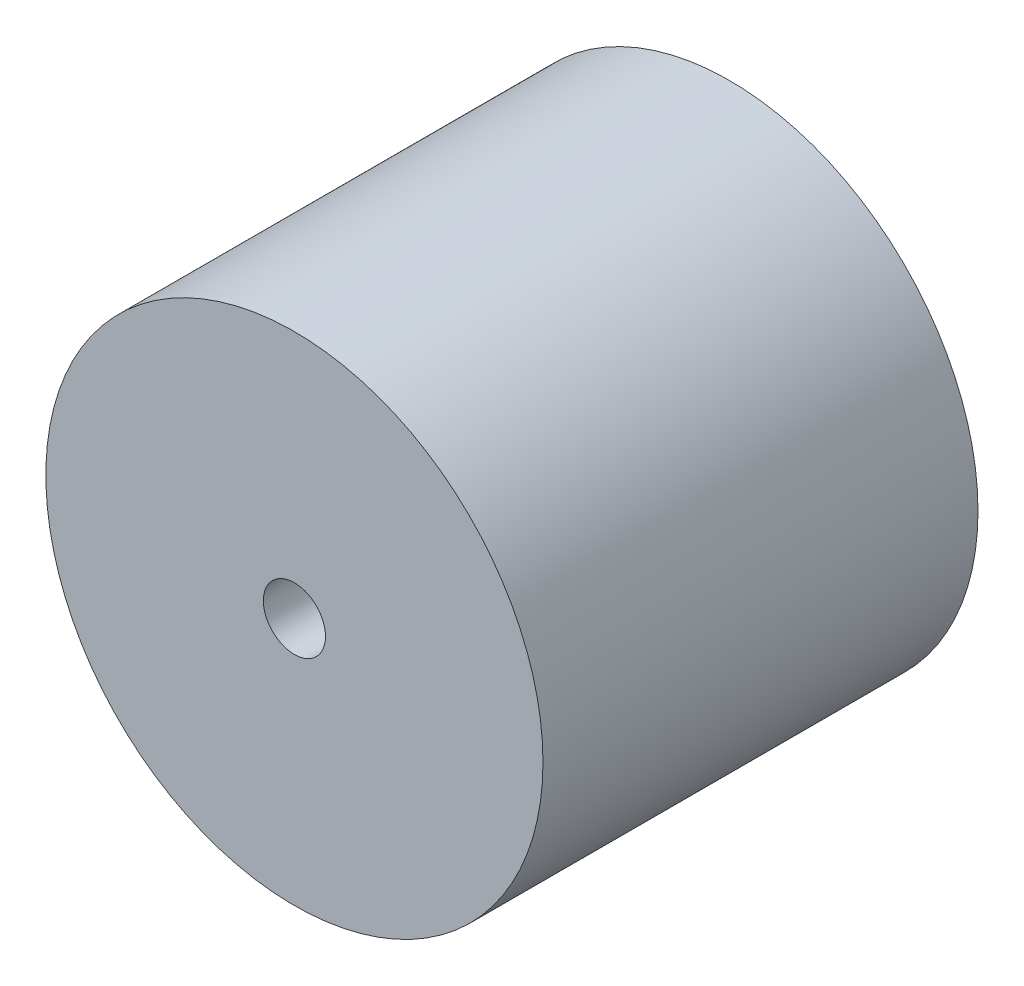
ISO-10303-21;
HEADER;
FILE_DESCRIPTION(('STEP AP214'),'2;1');
FILE_NAME('part.step','',(''),(''),'','','');
FILE_SCHEMA(('AUTOMOTIVE_DESIGN { 1 0 10303 214 1 1 1 1 }'));
ENDSEC;
DATA;
#1=APPLICATION_CONTEXT('core data for automotive mechanical design processes');
#2=APPLICATION_PROTOCOL_DEFINITION('international standard','automotive_design',2000,#1);
#3=PRODUCT_CONTEXT('',#1,'mechanical');
#4=PRODUCT('Part','Part','',(#3));
#5=PRODUCT_RELATED_PRODUCT_CATEGORY('part','',(#4));
#6=PRODUCT_DEFINITION_FORMATION('','',#4);
#7=PRODUCT_DEFINITION_CONTEXT('part definition',#1,'design');
#8=PRODUCT_DEFINITION('design','',#6,#7);
#9=PRODUCT_DEFINITION_SHAPE('','',#8);
#10=(LENGTH_UNIT() NAMED_UNIT(*) SI_UNIT(.MILLI.,.METRE.));
#11=(NAMED_UNIT(*) PLANE_ANGLE_UNIT() SI_UNIT($,.RADIAN.));
#12=(NAMED_UNIT(*) SI_UNIT($,.STERADIAN.) SOLID_ANGLE_UNIT());
#13=UNCERTAINTY_MEASURE_WITH_UNIT(LENGTH_MEASURE(1.E-05),#10,'distance_accuracy_value','');
#14=(GEOMETRIC_REPRESENTATION_CONTEXT(3) GLOBAL_UNCERTAINTY_ASSIGNED_CONTEXT((#13)) GLOBAL_UNIT_ASSIGNED_CONTEXT((#10,
#11,#12)) REPRESENTATION_CONTEXT('',''));
#15=CARTESIAN_POINT('',(0.,0.,0.));
#16=DIRECTION('',(0.,0.,1.));
#17=DIRECTION('',(1.,0.,0.));
#18=AXIS2_PLACEMENT_3D('',#15,#16,#17);
#19=CARTESIAN_POINT('',(0.,0.,35.));
#20=DIRECTION('',(0.,0.,1.));
#21=DIRECTION('',(1.,0.,0.));
#22=AXIS2_PLACEMENT_3D('',#19,#20,#21);
#23=PLANE('',#22);
#24=CARTESIAN_POINT('',(0.,0.,35.));
#25=DIRECTION('',(0.,0.,1.));
#26=DIRECTION('',(1.,0.,0.));
#27=AXIS2_PLACEMENT_3D('',#24,#25,#26);
#28=CIRCLE('',#27,20.);
#29=CARTESIAN_POINT('',(20.,0.,35.));
#30=VERTEX_POINT('',#29);
#31=EDGE_CURVE('E10',#30,#30,#28,.T.);
#32=ORIENTED_EDGE('',*,*,#31,.T.);
#33=EDGE_LOOP('',(#32));
#34=FACE_BOUND('',#33,.T.);
#35=CARTESIAN_POINT('',(0.,0.,35.));
#36=DIRECTION('',(0.,0.,1.));
#37=DIRECTION('',(1.,0.,0.));
#38=AXIS2_PLACEMENT_3D('',#35,#36,#37);
#39=CIRCLE('',#38,2.5);
#40=CARTESIAN_POINT('',(2.5,0.,35.));
#41=VERTEX_POINT('',#40);
#42=EDGE_CURVE('E42',#41,#41,#39,.T.);
#43=ORIENTED_EDGE('',*,*,#42,.F.);
#44=EDGE_LOOP('',(#43));
#45=FACE_BOUND('',#44,.T.);
#46=ADVANCED_FACE('F31',(#34,#45),#23,.T.);
#47=CARTESIAN_POINT('',(0.,0.,0.));
#48=DIRECTION('',(0.,0.,1.));
#49=DIRECTION('',(1.,0.,0.));
#50=AXIS2_PLACEMENT_3D('',#47,#48,#49);
#51=PLANE('',#50);
#52=CARTESIAN_POINT('',(0.,0.,0.));
#53=DIRECTION('',(0.,0.,1.));
#54=DIRECTION('',(1.,0.,0.));
#55=AXIS2_PLACEMENT_3D('',#52,#53,#54);
#56=CIRCLE('',#55,20.);
#57=CARTESIAN_POINT('',(20.,0.,0.));
#58=VERTEX_POINT('',#57);
#59=EDGE_CURVE('E35',#58,#58,#56,.T.);
#60=ORIENTED_EDGE('',*,*,#59,.F.);
#61=EDGE_LOOP('',(#60));
#62=FACE_BOUND('',#61,.T.);
#63=CARTESIAN_POINT('',(0.,0.,0.));
#64=DIRECTION('',(0.,0.,1.));
#65=DIRECTION('',(1.,0.,0.));
#66=AXIS2_PLACEMENT_3D('',#63,#64,#65);
#67=CIRCLE('',#66,2.5);
#68=CARTESIAN_POINT('',(2.5,0.,0.));
#69=VERTEX_POINT('',#68);
#70=EDGE_CURVE('E44',#69,#69,#67,.T.);
#71=ORIENTED_EDGE('',*,*,#70,.T.);
#72=EDGE_LOOP('',(#71));
#73=FACE_BOUND('',#72,.T.);
#74=ADVANCED_FACE('F54',(#62,#73),#51,.F.);
#75=CARTESIAN_POINT('',(0.,0.,35.));
#76=DIRECTION('',(0.,0.,-1.));
#77=DIRECTION('',(-1.,0.,0.));
#78=AXIS2_PLACEMENT_3D('',#75,#76,#77);
#79=CYLINDRICAL_SURFACE('',#78,20.);
#80=ORIENTED_EDGE('',*,*,#31,.F.);
#81=EDGE_LOOP('',(#80));
#82=FACE_BOUND('',#81,.T.);
#83=ORIENTED_EDGE('',*,*,#59,.T.);
#84=EDGE_LOOP('',(#83));
#85=FACE_BOUND('',#84,.T.);
#86=ADVANCED_FACE('F33',(#82,#85),#79,.T.);
#87=CARTESIAN_POINT('',(0.,0.,35.));
#88=DIRECTION('',(0.,0.,-1.));
#89=DIRECTION('',(-1.,0.,0.));
#90=AXIS2_PLACEMENT_3D('',#87,#88,#89);
#91=CYLINDRICAL_SURFACE('',#90,2.5);
#92=ORIENTED_EDGE('',*,*,#42,.T.);
#93=EDGE_LOOP('',(#92));
#94=FACE_BOUND('',#93,.T.);
#95=ORIENTED_EDGE('',*,*,#70,.F.);
#96=EDGE_LOOP('',(#95));
#97=FACE_BOUND('',#96,.T.);
#98=ADVANCED_FACE('F50',(#94,#97),#91,.F.);
#99=CLOSED_SHELL('',(#46,#74,#86,#98));
#100=MANIFOLD_SOLID_BREP('B2',#99);
#101=ADVANCED_BREP_SHAPE_REPRESENTATION('',(#18,#100),#14);
#102=SHAPE_DEFINITION_REPRESENTATION(#9,#101);
ENDSEC;
END-ISO-10303-21;
